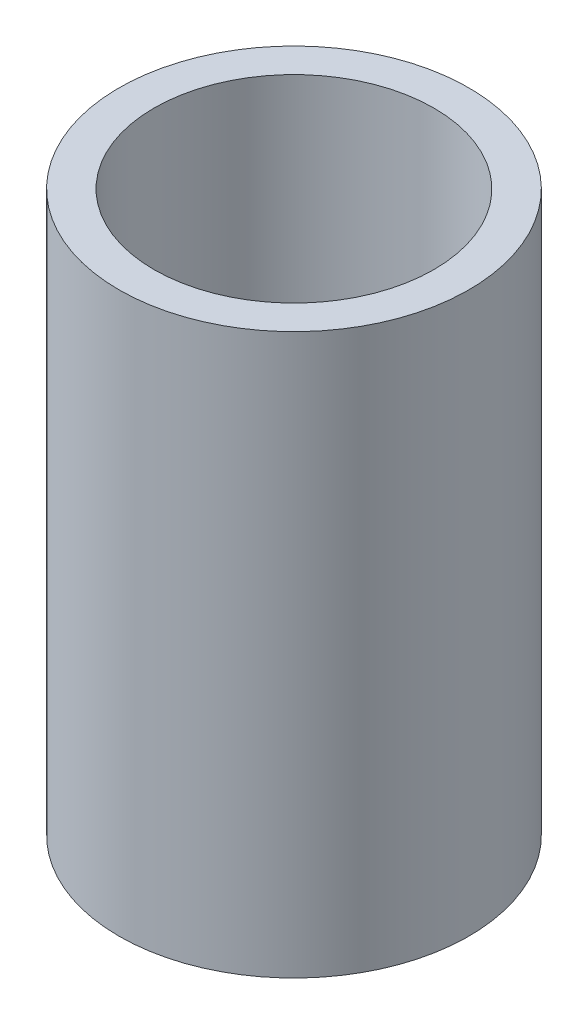
ISO-10303-21;
HEADER;
FILE_DESCRIPTION(('STEP AP214'),'2;1');
FILE_NAME('part.step','',(''),(''),'','','');
FILE_SCHEMA(('AUTOMOTIVE_DESIGN { 1 0 10303 214 1 1 1 1 }'));
ENDSEC;
DATA;
#1=APPLICATION_CONTEXT('core data for automotive mechanical design processes');
#2=APPLICATION_PROTOCOL_DEFINITION('international standard','automotive_design',2000,#1);
#3=PRODUCT_CONTEXT('',#1,'mechanical');
#4=PRODUCT('Part','Part','',(#3));
#5=PRODUCT_RELATED_PRODUCT_CATEGORY('part','',(#4));
#6=PRODUCT_DEFINITION_FORMATION('','',#4);
#7=PRODUCT_DEFINITION_CONTEXT('part definition',#1,'design');
#8=PRODUCT_DEFINITION('design','',#6,#7);
#9=PRODUCT_DEFINITION_SHAPE('','',#8);
#10=(LENGTH_UNIT() NAMED_UNIT(*) SI_UNIT(.MILLI.,.METRE.));
#11=(NAMED_UNIT(*) PLANE_ANGLE_UNIT() SI_UNIT($,.RADIAN.));
#12=(NAMED_UNIT(*) SI_UNIT($,.STERADIAN.) SOLID_ANGLE_UNIT());
#13=UNCERTAINTY_MEASURE_WITH_UNIT(LENGTH_MEASURE(1.E-05),#10,'distance_accuracy_value','');
#14=(GEOMETRIC_REPRESENTATION_CONTEXT(3) GLOBAL_UNCERTAINTY_ASSIGNED_CONTEXT((#13)) GLOBAL_UNIT_ASSIGNED_CONTEXT((#10,
#11,#12)) REPRESENTATION_CONTEXT('',''));
#15=CARTESIAN_POINT('',(0.,0.,0.));
#16=DIRECTION('',(0.,0.,1.));
#17=DIRECTION('',(1.,0.,0.));
#18=AXIS2_PLACEMENT_3D('',#15,#16,#17);
#19=CARTESIAN_POINT('',(0.,12.,0.));
#20=DIRECTION('',(0.,1.,0.));
#21=DIRECTION('',(0.,0.,1.));
#22=AXIS2_PLACEMENT_3D('',#19,#20,#21);
#23=PLANE('',#22);
#24=CARTESIAN_POINT('',(0.,12.,0.));
#25=DIRECTION('',(0.,1.,0.));
#26=DIRECTION('',(0.,0.,1.));
#27=AXIS2_PLACEMENT_3D('',#24,#25,#26);
#28=CIRCLE('',#27,7.5);
#29=CARTESIAN_POINT('',(0.,12.,7.5));
#30=VERTEX_POINT('',#29);
#31=EDGE_CURVE('E10',#30,#30,#28,.T.);
#32=ORIENTED_EDGE('',*,*,#31,.T.);
#33=EDGE_LOOP('',(#32));
#34=FACE_BOUND('',#33,.T.);
#35=CARTESIAN_POINT('',(0.,12.,0.));
#36=DIRECTION('',(0.,1.,0.));
#37=DIRECTION('',(0.,0.,1.));
#38=AXIS2_PLACEMENT_3D('',#35,#36,#37);
#39=CIRCLE('',#38,6.);
#40=CARTESIAN_POINT('',(0.,12.,6.));
#41=VERTEX_POINT('',#40);
#42=EDGE_CURVE('E50',#41,#41,#39,.T.);
#43=ORIENTED_EDGE('',*,*,#42,.F.);
#44=EDGE_LOOP('',(#43));
#45=FACE_BOUND('',#44,.T.);
#46=ADVANCED_FACE('F37',(#34,#45),#23,.T.);
#47=CARTESIAN_POINT('',(0.,-12.,0.));
#48=DIRECTION('',(0.,1.,0.));
#49=DIRECTION('',(0.,0.,1.));
#50=AXIS2_PLACEMENT_3D('',#47,#48,#49);
#51=PLANE('',#50);
#52=CARTESIAN_POINT('',(0.,-12.,0.));
#53=DIRECTION('',(0.,1.,0.));
#54=DIRECTION('',(0.,0.,1.));
#55=AXIS2_PLACEMENT_3D('',#52,#53,#54);
#56=CIRCLE('',#55,7.5);
#57=CARTESIAN_POINT('',(0.,-12.,7.5));
#58=VERTEX_POINT('',#57);
#59=EDGE_CURVE('E41',#58,#58,#56,.T.);
#60=ORIENTED_EDGE('',*,*,#59,.F.);
#61=EDGE_LOOP('',(#60));
#62=FACE_BOUND('',#61,.T.);
#63=CARTESIAN_POINT('',(0.,-12.,0.));
#64=DIRECTION('',(0.,1.,0.));
#65=DIRECTION('',(0.,0.,1.));
#66=AXIS2_PLACEMENT_3D('',#63,#64,#65);
#67=CIRCLE('',#66,6.);
#68=CARTESIAN_POINT('',(0.,-12.,6.));
#69=VERTEX_POINT('',#68);
#70=EDGE_CURVE('E52',#69,#69,#67,.T.);
#71=ORIENTED_EDGE('',*,*,#70,.T.);
#72=EDGE_LOOP('',(#71));
#73=FACE_BOUND('',#72,.T.);
#74=ADVANCED_FACE('F64',(#62,#73),#51,.F.);
#75=CARTESIAN_POINT('',(0.,12.,0.));
#76=DIRECTION('',(0.,-1.,0.));
#77=DIRECTION('',(0.,0.,-1.));
#78=AXIS2_PLACEMENT_3D('',#75,#76,#77);
#79=CYLINDRICAL_SURFACE('',#78,7.5);
#80=ORIENTED_EDGE('',*,*,#31,.F.);
#81=EDGE_LOOP('',(#80));
#82=FACE_BOUND('',#81,.T.);
#83=ORIENTED_EDGE('',*,*,#59,.T.);
#84=EDGE_LOOP('',(#83));
#85=FACE_BOUND('',#84,.T.);
#86=ADVANCED_FACE('F39',(#82,#85),#79,.T.);
#87=CARTESIAN_POINT('',(0.,12.,0.));
#88=DIRECTION('',(0.,-1.,0.));
#89=DIRECTION('',(0.,0.,-1.));
#90=AXIS2_PLACEMENT_3D('',#87,#88,#89);
#91=CYLINDRICAL_SURFACE('',#90,6.);
#92=ORIENTED_EDGE('',*,*,#42,.T.);
#93=EDGE_LOOP('',(#92));
#94=FACE_BOUND('',#93,.T.);
#95=ORIENTED_EDGE('',*,*,#70,.F.);
#96=EDGE_LOOP('',(#95));
#97=FACE_BOUND('',#96,.T.);
#98=ADVANCED_FACE('F60',(#94,#97),#91,.F.);
#99=CLOSED_SHELL('',(#46,#74,#86,#98));
#100=MANIFOLD_SOLID_BREP('B2',#99);
#101=ADVANCED_BREP_SHAPE_REPRESENTATION('',(#18,#100),#14);
#102=SHAPE_DEFINITION_REPRESENTATION(#9,#101);
ENDSEC;
END-ISO-10303-21;
